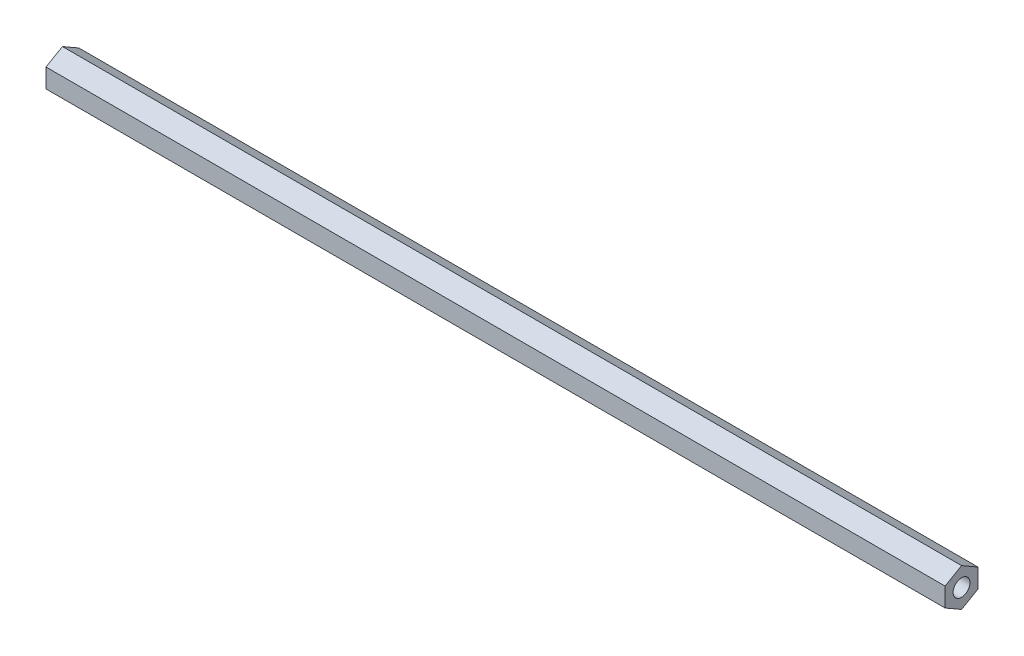
ISO-10303-21;
HEADER;
FILE_DESCRIPTION(('STEP AP214'),'2;1');
FILE_NAME('part.step','',(''),(''),'','','');
FILE_SCHEMA(('AUTOMOTIVE_DESIGN { 1 0 10303 214 1 1 1 1 }'));
ENDSEC;
DATA;
#1=APPLICATION_CONTEXT('core data for automotive mechanical design processes');
#2=APPLICATION_PROTOCOL_DEFINITION('international standard','automotive_design',2000,#1);
#3=PRODUCT_CONTEXT('',#1,'mechanical');
#4=PRODUCT('Part','Part','',(#3));
#5=PRODUCT_RELATED_PRODUCT_CATEGORY('part','',(#4));
#6=PRODUCT_DEFINITION_FORMATION('','',#4);
#7=PRODUCT_DEFINITION_CONTEXT('part definition',#1,'design');
#8=PRODUCT_DEFINITION('design','',#6,#7);
#9=PRODUCT_DEFINITION_SHAPE('','',#8);
#10=(LENGTH_UNIT() NAMED_UNIT(*) SI_UNIT(.MILLI.,.METRE.));
#11=(NAMED_UNIT(*) PLANE_ANGLE_UNIT() SI_UNIT($,.RADIAN.));
#12=(NAMED_UNIT(*) SI_UNIT($,.STERADIAN.) SOLID_ANGLE_UNIT());
#13=UNCERTAINTY_MEASURE_WITH_UNIT(LENGTH_MEASURE(1.E-05),#10,'distance_accuracy_value','');
#14=(GEOMETRIC_REPRESENTATION_CONTEXT(3) GLOBAL_UNCERTAINTY_ASSIGNED_CONTEXT((#13)) GLOBAL_UNIT_ASSIGNED_CONTEXT((#10,
#11,#12)) REPRESENTATION_CONTEXT('',''));
#15=CARTESIAN_POINT('',(0.,0.,0.));
#16=DIRECTION('',(0.,0.,1.));
#17=DIRECTION('',(1.,0.,0.));
#18=AXIS2_PLACEMENT_3D('',#15,#16,#17);
#19=CARTESIAN_POINT('',(346.86875,3.66617420935419,-6.34999999999995));
#20=DIRECTION('',(0.,-0.866025403784441,0.499999999999995));
#21=DIRECTION('',(0.,-0.499999999999995,-0.866025403784442));
#22=AXIS2_PLACEMENT_3D('',#19,#20,#21);
#23=PLANE('',#22);
#24=DIRECTION('',(0.,0.499999999999995,0.866025403784442));
#25=VECTOR('',#24,1.);
#26=CARTESIAN_POINT('',(0.,3.66617420935419,-6.34999999999995));
#27=LINE('',#26,#25);
#28=CARTESIAN_POINT('',(0.,3.66617420935419,-6.34999999999995));
#29=VERTEX_POINT('',#28);
#30=CARTESIAN_POINT('',(0.,7.33234841870824,0.));
#31=VERTEX_POINT('',#30);
#32=EDGE_CURVE('E128',#29,#31,#27,.T.);
#33=ORIENTED_EDGE('',*,*,#32,.T.);
#34=DIRECTION('',(-1.,0.,0.));
#35=VECTOR('',#34,1.);
#36=CARTESIAN_POINT('',(346.86875,7.33234841870824,0.));
#37=LINE('',#36,#35);
#38=CARTESIAN_POINT('',(346.86875,7.33234841870824,0.));
#39=VERTEX_POINT('',#38);
#40=EDGE_CURVE('E11',#39,#31,#37,.T.);
#41=ORIENTED_EDGE('',*,*,#40,.F.);
#42=DIRECTION('',(0.,0.499999999999995,0.866025403784442));
#43=VECTOR('',#42,1.);
#44=CARTESIAN_POINT('',(346.86875,3.66617420935419,-6.34999999999995));
#45=LINE('',#44,#43);
#46=CARTESIAN_POINT('',(346.86875,3.66617420935419,-6.34999999999995));
#47=VERTEX_POINT('',#46);
#48=EDGE_CURVE('E145',#47,#39,#45,.T.);
#49=ORIENTED_EDGE('',*,*,#48,.F.);
#50=DIRECTION('',(-1.,0.,0.));
#51=VECTOR('',#50,1.);
#52=CARTESIAN_POINT('',(346.86875,3.66617420935419,-6.34999999999995));
#53=LINE('',#52,#51);
#54=EDGE_CURVE('E124',#47,#29,#53,.T.);
#55=ORIENTED_EDGE('',*,*,#54,.T.);
#56=EDGE_LOOP('',(#33,#41,#49,#55));
#57=FACE_BOUND('',#56,.T.);
#58=ADVANCED_FACE('F39',(#57),#23,.F.);
#59=CARTESIAN_POINT('',(346.86875,7.33234841870824,0.));
#60=DIRECTION('',(0.,-0.866025403784438,-0.500000000000001));
#61=DIRECTION('',(0.,0.500000000000001,-0.866025403784438));
#62=AXIS2_PLACEMENT_3D('',#59,#60,#61);
#63=PLANE('',#62);
#64=DIRECTION('',(0.,-0.500000000000001,0.866025403784438));
#65=VECTOR('',#64,1.);
#66=CARTESIAN_POINT('',(0.,7.33234841870824,0.));
#67=LINE('',#66,#65);
#68=CARTESIAN_POINT('',(0.,3.6661742093541,6.35));
#69=VERTEX_POINT('',#68);
#70=EDGE_CURVE('E132',#31,#69,#67,.T.);
#71=ORIENTED_EDGE('',*,*,#70,.T.);
#72=DIRECTION('',(-1.,0.,0.));
#73=VECTOR('',#72,1.);
#74=CARTESIAN_POINT('',(346.86875,3.6661742093541,6.35));
#75=LINE('',#74,#73);
#76=CARTESIAN_POINT('',(346.86875,3.6661742093541,6.35));
#77=VERTEX_POINT('',#76);
#78=EDGE_CURVE('E48',#77,#69,#75,.T.);
#79=ORIENTED_EDGE('',*,*,#78,.F.);
#80=DIRECTION('',(0.,-0.500000000000001,0.866025403784438));
#81=VECTOR('',#80,1.);
#82=CARTESIAN_POINT('',(346.86875,7.33234841870824,0.));
#83=LINE('',#82,#81);
#84=EDGE_CURVE('E93',#39,#77,#83,.T.);
#85=ORIENTED_EDGE('',*,*,#84,.F.);
#86=ORIENTED_EDGE('',*,*,#40,.T.);
#87=EDGE_LOOP('',(#71,#79,#85,#86));
#88=FACE_BOUND('',#87,.T.);
#89=ADVANCED_FACE('F174',(#88),#63,.F.);
#90=CARTESIAN_POINT('',(346.86875,3.6661742093541,6.35));
#91=DIRECTION('',(0.,0.,-1.));
#92=DIRECTION('',(0.,1.,0.));
#93=AXIS2_PLACEMENT_3D('',#90,#91,#92);
#94=PLANE('',#93);
#95=DIRECTION('',(0.,-1.,0.));
#96=VECTOR('',#95,1.);
#97=CARTESIAN_POINT('',(0.,3.6661742093541,6.35));
#98=LINE('',#97,#96);
#99=CARTESIAN_POINT('',(0.,-3.66617420935415,6.34999999999997));
#100=VERTEX_POINT('',#99);
#101=EDGE_CURVE('E136',#69,#100,#98,.T.);
#102=ORIENTED_EDGE('',*,*,#101,.T.);
#103=DIRECTION('',(-1.,0.,0.));
#104=VECTOR('',#103,1.);
#105=CARTESIAN_POINT('',(346.86875,-3.66617420935415,6.34999999999997));
#106=LINE('',#105,#104);
#107=CARTESIAN_POINT('',(346.86875,-3.66617420935415,6.34999999999997));
#108=VERTEX_POINT('',#107);
#109=EDGE_CURVE('E117',#108,#100,#106,.T.);
#110=ORIENTED_EDGE('',*,*,#109,.F.);
#111=DIRECTION('',(0.,-1.,0.));
#112=VECTOR('',#111,1.);
#113=CARTESIAN_POINT('',(346.86875,3.6661742093541,6.35));
#114=LINE('',#113,#112);
#115=EDGE_CURVE('E106',#77,#108,#114,.T.);
#116=ORIENTED_EDGE('',*,*,#115,.F.);
#117=ORIENTED_EDGE('',*,*,#78,.T.);
#118=EDGE_LOOP('',(#102,#110,#116,#117));
#119=FACE_BOUND('',#118,.T.);
#120=ADVANCED_FACE('F155',(#119),#94,.F.);
#121=CARTESIAN_POINT('',(346.86875,-3.66617420935415,6.34999999999997));
#122=DIRECTION('',(0.,0.866025403784442,-0.499999999999995));
#123=DIRECTION('',(0.,0.499999999999995,0.866025403784442));
#124=AXIS2_PLACEMENT_3D('',#121,#122,#123);
#125=PLANE('',#124);
#126=DIRECTION('',(0.,-0.499999999999995,-0.866025403784442));
#127=VECTOR('',#126,1.);
#128=CARTESIAN_POINT('',(0.,-3.66617420935415,6.34999999999997));
#129=LINE('',#128,#127);
#130=CARTESIAN_POINT('',(0.,-7.33234841870823,0.));
#131=VERTEX_POINT('',#130);
#132=EDGE_CURVE('E115',#100,#131,#129,.T.);
#133=ORIENTED_EDGE('',*,*,#132,.T.);
#134=DIRECTION('',(-1.,0.,0.));
#135=VECTOR('',#134,1.);
#136=CARTESIAN_POINT('',(346.86875,-7.33234841870823,0.));
#137=LINE('',#136,#135);
#138=CARTESIAN_POINT('',(346.86875,-7.33234841870823,0.));
#139=VERTEX_POINT('',#138);
#140=EDGE_CURVE('E112',#139,#131,#137,.T.);
#141=ORIENTED_EDGE('',*,*,#140,.F.);
#142=DIRECTION('',(0.,-0.499999999999995,-0.866025403784442));
#143=VECTOR('',#142,1.);
#144=CARTESIAN_POINT('',(346.86875,-3.66617420935415,6.34999999999997));
#145=LINE('',#144,#143);
#146=EDGE_CURVE('E100',#108,#139,#145,.T.);
#147=ORIENTED_EDGE('',*,*,#146,.F.);
#148=ORIENTED_EDGE('',*,*,#109,.T.);
#149=EDGE_LOOP('',(#133,#141,#147,#148));
#150=FACE_BOUND('',#149,.T.);
#151=ADVANCED_FACE('F113',(#150),#125,.F.);
#152=CARTESIAN_POINT('',(346.86875,-7.33234841870823,0.));
#153=DIRECTION('',(0.,0.866025403784435,0.500000000000007));
#154=DIRECTION('',(0.,-0.500000000000007,0.866025403784435));
#155=AXIS2_PLACEMENT_3D('',#152,#153,#154);
#156=PLANE('',#155);
#157=DIRECTION('',(0.,0.500000000000007,-0.866025403784435));
#158=VECTOR('',#157,1.);
#159=CARTESIAN_POINT('',(0.,-7.33234841870823,0.));
#160=LINE('',#159,#158);
#161=CARTESIAN_POINT('',(0.,-3.66617420935406,-6.35000000000002));
#162=VERTEX_POINT('',#161);
#163=EDGE_CURVE('E79',#131,#162,#160,.T.);
#164=ORIENTED_EDGE('',*,*,#163,.T.);
#165=DIRECTION('',(-1.,0.,0.));
#166=VECTOR('',#165,1.);
#167=CARTESIAN_POINT('',(346.86875,-3.66617420935406,-6.35000000000002));
#168=LINE('',#167,#166);
#169=CARTESIAN_POINT('',(346.86875,-3.66617420935406,-6.35000000000002));
#170=VERTEX_POINT('',#169);
#171=EDGE_CURVE('E118',#170,#162,#168,.T.);
#172=ORIENTED_EDGE('',*,*,#171,.F.);
#173=DIRECTION('',(0.,0.500000000000007,-0.866025403784435));
#174=VECTOR('',#173,1.);
#175=CARTESIAN_POINT('',(346.86875,-7.33234841870823,0.));
#176=LINE('',#175,#174);
#177=EDGE_CURVE('E104',#139,#170,#176,.T.);
#178=ORIENTED_EDGE('',*,*,#177,.F.);
#179=ORIENTED_EDGE('',*,*,#140,.T.);
#180=EDGE_LOOP('',(#164,#172,#178,#179));
#181=FACE_BOUND('',#180,.T.);
#182=ADVANCED_FACE('F120',(#181),#156,.F.);
#183=CARTESIAN_POINT('',(346.86875,-3.66617420935406,-6.35000000000002));
#184=DIRECTION('',(0.,0.,1.));
#185=DIRECTION('',(0.,-1.,0.));
#186=AXIS2_PLACEMENT_3D('',#183,#184,#185);
#187=PLANE('',#186);
#188=DIRECTION('',(0.,1.,0.));
#189=VECTOR('',#188,1.);
#190=CARTESIAN_POINT('',(0.,-3.66617420935406,-6.35000000000002));
#191=LINE('',#190,#189);
#192=EDGE_CURVE('E85',#162,#29,#191,.T.);
#193=ORIENTED_EDGE('',*,*,#192,.T.);
#194=ORIENTED_EDGE('',*,*,#54,.F.);
#195=DIRECTION('',(0.,1.,0.));
#196=VECTOR('',#195,1.);
#197=CARTESIAN_POINT('',(346.86875,-3.66617420935406,-6.35000000000002));
#198=LINE('',#197,#196);
#199=EDGE_CURVE('E56',#170,#47,#198,.T.);
#200=ORIENTED_EDGE('',*,*,#199,.F.);
#201=ORIENTED_EDGE('',*,*,#171,.T.);
#202=EDGE_LOOP('',(#193,#194,#200,#201));
#203=FACE_BOUND('',#202,.T.);
#204=ADVANCED_FACE('F162',(#203),#187,.F.);
#205=CARTESIAN_POINT('',(346.86875,0.,0.));
#206=DIRECTION('',(1.,0.,0.));
#207=DIRECTION('',(0.,0.,-1.));
#208=AXIS2_PLACEMENT_3D('',#205,#206,#207);
#209=PLANE('',#208);
#210=CARTESIAN_POINT('',(346.86875,0.,0.));
#211=DIRECTION('',(1.,0.,0.));
#212=DIRECTION('',(0.,0.,-1.));
#213=AXIS2_PLACEMENT_3D('',#210,#211,#212);
#214=CIRCLE('',#213,3.2639);
#215=CARTESIAN_POINT('',(346.86875,0.,-3.2639));
#216=VERTEX_POINT('',#215);
#217=EDGE_CURVE('E258',#216,#216,#214,.T.);
#218=ORIENTED_EDGE('',*,*,#217,.F.);
#219=EDGE_LOOP('',(#218));
#220=FACE_BOUND('',#219,.T.);
#221=ORIENTED_EDGE('',*,*,#48,.T.);
#222=ORIENTED_EDGE('',*,*,#84,.T.);
#223=ORIENTED_EDGE('',*,*,#115,.T.);
#224=ORIENTED_EDGE('',*,*,#146,.T.);
#225=ORIENTED_EDGE('',*,*,#177,.T.);
#226=ORIENTED_EDGE('',*,*,#199,.T.);
#227=EDGE_LOOP('',(#221,#222,#223,#224,#225,#226));
#228=FACE_BOUND('',#227,.T.);
#229=ADVANCED_FACE('F102',(#220,#228),#209,.T.);
#230=CARTESIAN_POINT('',(0.,0.,0.));
#231=DIRECTION('',(1.,0.,0.));
#232=DIRECTION('',(0.,0.,-1.));
#233=AXIS2_PLACEMENT_3D('',#230,#231,#232);
#234=PLANE('',#233);
#235=CARTESIAN_POINT('',(0.,0.,0.));
#236=DIRECTION('',(-1.,0.,0.));
#237=DIRECTION('',(0.,0.,1.));
#238=AXIS2_PLACEMENT_3D('',#235,#236,#237);
#239=CIRCLE('',#238,3.2639);
#240=CARTESIAN_POINT('',(0.,0.,3.2639));
#241=VERTEX_POINT('',#240);
#242=EDGE_CURVE('E259',#241,#241,#239,.T.);
#243=ORIENTED_EDGE('',*,*,#242,.F.);
#244=EDGE_LOOP('',(#243));
#245=FACE_BOUND('',#244,.T.);
#246=ORIENTED_EDGE('',*,*,#32,.F.);
#247=ORIENTED_EDGE('',*,*,#192,.F.);
#248=ORIENTED_EDGE('',*,*,#163,.F.);
#249=ORIENTED_EDGE('',*,*,#132,.F.);
#250=ORIENTED_EDGE('',*,*,#101,.F.);
#251=ORIENTED_EDGE('',*,*,#70,.F.);
#252=EDGE_LOOP('',(#246,#247,#248,#249,#250,#251));
#253=FACE_BOUND('',#252,.T.);
#254=ADVANCED_FACE('F158',(#245,#253),#234,.F.);
#255=CARTESIAN_POINT('',(334.16875,0.,0.));
#256=DIRECTION('',(1.,0.,0.));
#257=DIRECTION('',(0.,0.,-1.));
#258=AXIS2_PLACEMENT_3D('',#255,#256,#257);
#259=CYLINDRICAL_SURFACE('',#258,3.2639);
#260=CARTESIAN_POINT('',(334.16875,0.,0.));
#261=DIRECTION('',(1.,0.,0.));
#262=DIRECTION('',(0.,0.,-1.));
#263=AXIS2_PLACEMENT_3D('',#260,#261,#262);
#264=CIRCLE('',#263,3.2639);
#265=CARTESIAN_POINT('',(334.16875,0.,-3.2639));
#266=VERTEX_POINT('',#265);
#267=EDGE_CURVE('E133',#266,#266,#264,.T.);
#268=ORIENTED_EDGE('',*,*,#267,.F.);
#269=EDGE_LOOP('',(#268));
#270=FACE_BOUND('',#269,.T.);
#271=ORIENTED_EDGE('',*,*,#217,.T.);
#272=EDGE_LOOP('',(#271));
#273=FACE_BOUND('',#272,.T.);
#274=ADVANCED_FACE('F209',(#270,#273),#259,.F.);
#275=CARTESIAN_POINT('',(334.16875,0.,0.));
#276=DIRECTION('',(1.,0.,0.));
#277=DIRECTION('',(0.,0.,-1.));
#278=AXIS2_PLACEMENT_3D('',#275,#276,#277);
#279=PLANE('',#278);
#280=ORIENTED_EDGE('',*,*,#267,.T.);
#281=EDGE_LOOP('',(#280));
#282=FACE_BOUND('',#281,.T.);
#283=ADVANCED_FACE('F214',(#282),#279,.T.);
#284=CARTESIAN_POINT('',(12.7,0.,0.));
#285=DIRECTION('',(-1.,0.,0.));
#286=DIRECTION('',(0.,0.,1.));
#287=AXIS2_PLACEMENT_3D('',#284,#285,#286);
#288=CYLINDRICAL_SURFACE('',#287,3.2639);
#289=CARTESIAN_POINT('',(12.7,0.,0.));
#290=DIRECTION('',(-1.,0.,0.));
#291=DIRECTION('',(0.,0.,1.));
#292=AXIS2_PLACEMENT_3D('',#289,#290,#291);
#293=CIRCLE('',#292,3.2639);
#294=CARTESIAN_POINT('',(12.7,0.,3.2639));
#295=VERTEX_POINT('',#294);
#296=EDGE_CURVE('E256',#295,#295,#293,.T.);
#297=ORIENTED_EDGE('',*,*,#296,.F.);
#298=EDGE_LOOP('',(#297));
#299=FACE_BOUND('',#298,.T.);
#300=ORIENTED_EDGE('',*,*,#242,.T.);
#301=EDGE_LOOP('',(#300));
#302=FACE_BOUND('',#301,.T.);
#303=ADVANCED_FACE('F224',(#299,#302),#288,.F.);
#304=CARTESIAN_POINT('',(12.7,0.,0.));
#305=DIRECTION('',(-1.,0.,0.));
#306=DIRECTION('',(0.,0.,1.));
#307=AXIS2_PLACEMENT_3D('',#304,#305,#306);
#308=PLANE('',#307);
#309=ORIENTED_EDGE('',*,*,#296,.T.);
#310=EDGE_LOOP('',(#309));
#311=FACE_BOUND('',#310,.T.);
#312=ADVANCED_FACE('F240',(#311),#308,.T.);
#313=CLOSED_SHELL('',(#58,#89,#120,#151,#182,#204,#229,#254,#274,#283,#303,#312));
#314=MANIFOLD_SOLID_BREP('B2',#313);
#315=ADVANCED_BREP_SHAPE_REPRESENTATION('',(#18,#314),#14);
#316=SHAPE_DEFINITION_REPRESENTATION(#9,#315);
ENDSEC;
END-ISO-10303-21;
